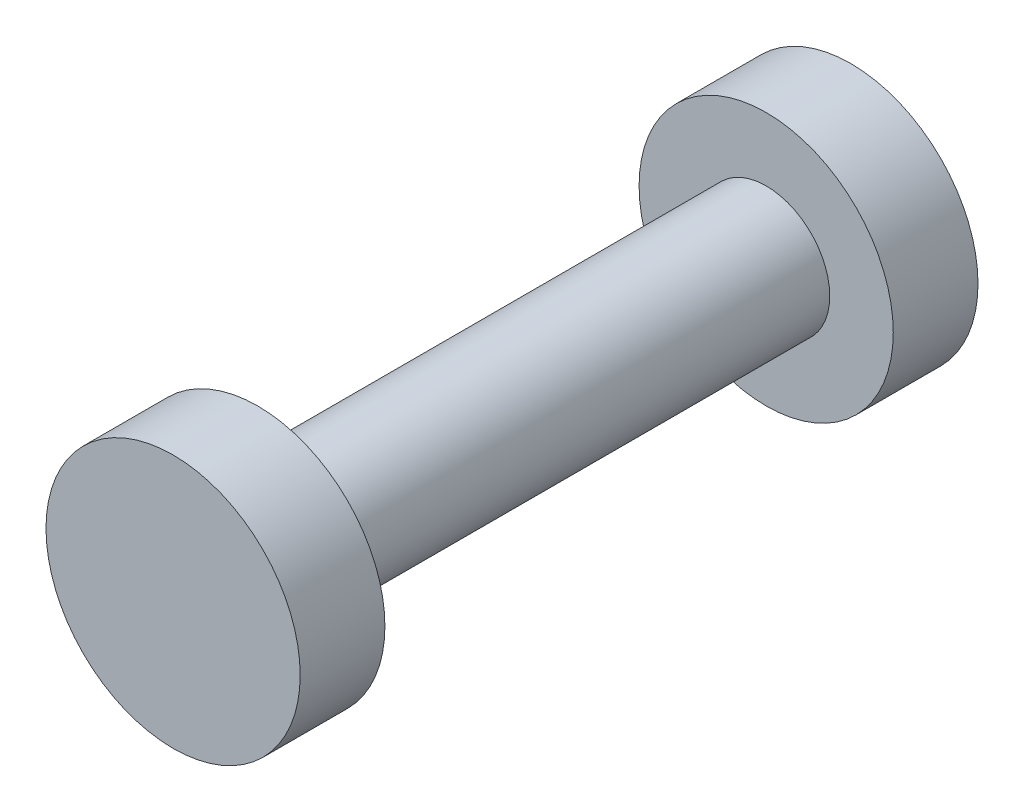
ISO-10303-21;
HEADER;
FILE_DESCRIPTION(('STEP AP214'),'2;1');
FILE_NAME('part.step','',(''),(''),'','','');
FILE_SCHEMA(('AUTOMOTIVE_DESIGN { 1 0 10303 214 1 1 1 1 }'));
ENDSEC;
DATA;
#1=APPLICATION_CONTEXT('core data for automotive mechanical design processes');
#2=APPLICATION_PROTOCOL_DEFINITION('international standard','automotive_design',2000,#1);
#3=PRODUCT_CONTEXT('',#1,'mechanical');
#4=PRODUCT('Part','Part','',(#3));
#5=PRODUCT_RELATED_PRODUCT_CATEGORY('part','',(#4));
#6=PRODUCT_DEFINITION_FORMATION('','',#4);
#7=PRODUCT_DEFINITION_CONTEXT('part definition',#1,'design');
#8=PRODUCT_DEFINITION('design','',#6,#7);
#9=PRODUCT_DEFINITION_SHAPE('','',#8);
#10=(LENGTH_UNIT() NAMED_UNIT(*) SI_UNIT(.MILLI.,.METRE.));
#11=(NAMED_UNIT(*) PLANE_ANGLE_UNIT() SI_UNIT($,.RADIAN.));
#12=(NAMED_UNIT(*) SI_UNIT($,.STERADIAN.) SOLID_ANGLE_UNIT());
#13=UNCERTAINTY_MEASURE_WITH_UNIT(LENGTH_MEASURE(1.E-05),#10,'distance_accuracy_value','');
#14=(GEOMETRIC_REPRESENTATION_CONTEXT(3) GLOBAL_UNCERTAINTY_ASSIGNED_CONTEXT((#13)) GLOBAL_UNIT_ASSIGNED_CONTEXT((#10,
#11,#12)) REPRESENTATION_CONTEXT('',''));
#15=CARTESIAN_POINT('',(0.,0.,0.));
#16=DIRECTION('',(0.,0.,1.));
#17=DIRECTION('',(1.,0.,0.));
#18=AXIS2_PLACEMENT_3D('',#15,#16,#17);
#19=CARTESIAN_POINT('',(0.,0.,15.24));
#20=DIRECTION('',(0.,0.,-1.));
#21=DIRECTION('',(-1.,0.,0.));
#22=AXIS2_PLACEMENT_3D('',#19,#20,#21);
#23=CYLINDRICAL_SURFACE('',#22,1.905);
#24=CARTESIAN_POINT('',(0.,0.,15.24));
#25=DIRECTION('',(0.,0.,1.));
#26=DIRECTION('',(1.,0.,0.));
#27=AXIS2_PLACEMENT_3D('',#24,#25,#26);
#28=CIRCLE('',#27,1.905);
#29=CARTESIAN_POINT('',(1.905,0.,15.24));
#30=VERTEX_POINT('',#29);
#31=EDGE_CURVE('E10',#30,#30,#28,.T.);
#32=ORIENTED_EDGE('',*,*,#31,.F.);
#33=EDGE_LOOP('',(#32));
#34=FACE_BOUND('',#33,.T.);
#35=CARTESIAN_POINT('',(0.,0.,0.));
#36=DIRECTION('',(0.,0.,1.));
#37=DIRECTION('',(1.,0.,0.));
#38=AXIS2_PLACEMENT_3D('',#35,#36,#37);
#39=CIRCLE('',#38,1.905);
#40=CARTESIAN_POINT('',(1.905,0.,0.));
#41=VERTEX_POINT('',#40);
#42=EDGE_CURVE('E40',#41,#41,#39,.T.);
#43=ORIENTED_EDGE('',*,*,#42,.T.);
#44=EDGE_LOOP('',(#43));
#45=FACE_BOUND('',#44,.T.);
#46=ADVANCED_FACE('F37',(#34,#45),#23,.T.);
#47=CARTESIAN_POINT('',(0.,0.,17.78));
#48=DIRECTION('',(0.,0.,-1.));
#49=DIRECTION('',(-1.,0.,0.));
#50=AXIS2_PLACEMENT_3D('',#47,#48,#49);
#51=CYLINDRICAL_SURFACE('',#50,3.81);
#52=CARTESIAN_POINT('',(0.,0.,17.78));
#53=DIRECTION('',(0.,0.,1.));
#54=DIRECTION('',(1.,0.,0.));
#55=AXIS2_PLACEMENT_3D('',#52,#53,#54);
#56=CIRCLE('',#55,3.81);
#57=CARTESIAN_POINT('',(3.81,0.,17.78));
#58=VERTEX_POINT('',#57);
#59=EDGE_CURVE('E45',#58,#58,#56,.T.);
#60=ORIENTED_EDGE('',*,*,#59,.F.);
#61=EDGE_LOOP('',(#60));
#62=FACE_BOUND('',#61,.T.);
#63=CARTESIAN_POINT('',(0.,0.,15.24));
#64=DIRECTION('',(0.,0.,1.));
#65=DIRECTION('',(1.,0.,0.));
#66=AXIS2_PLACEMENT_3D('',#63,#64,#65);
#67=CIRCLE('',#66,3.81);
#68=CARTESIAN_POINT('',(3.81,0.,15.24));
#69=VERTEX_POINT('',#68);
#70=EDGE_CURVE('E50',#69,#69,#67,.T.);
#71=ORIENTED_EDGE('',*,*,#70,.T.);
#72=EDGE_LOOP('',(#71));
#73=FACE_BOUND('',#72,.T.);
#74=ADVANCED_FACE('F91',(#62,#73),#51,.T.);
#75=CARTESIAN_POINT('',(0.,0.,17.78));
#76=DIRECTION('',(0.,0.,1.));
#77=DIRECTION('',(1.,0.,0.));
#78=AXIS2_PLACEMENT_3D('',#75,#76,#77);
#79=PLANE('',#78);
#80=ORIENTED_EDGE('',*,*,#59,.T.);
#81=EDGE_LOOP('',(#80));
#82=FACE_BOUND('',#81,.T.);
#83=ADVANCED_FACE('F87',(#82),#79,.T.);
#84=CARTESIAN_POINT('',(0.,0.,15.24));
#85=DIRECTION('',(0.,0.,1.));
#86=DIRECTION('',(1.,0.,0.));
#87=AXIS2_PLACEMENT_3D('',#84,#85,#86);
#88=PLANE('',#87);
#89=ORIENTED_EDGE('',*,*,#31,.T.);
#90=EDGE_LOOP('',(#89));
#91=FACE_BOUND('',#90,.T.);
#92=ORIENTED_EDGE('',*,*,#70,.F.);
#93=EDGE_LOOP('',(#92));
#94=FACE_BOUND('',#93,.T.);
#95=ADVANCED_FACE('F79',(#91,#94),#88,.F.);
#96=CARTESIAN_POINT('',(0.,0.,-2.54));
#97=DIRECTION('',(0.,0.,1.));
#98=DIRECTION('',(1.,0.,0.));
#99=AXIS2_PLACEMENT_3D('',#96,#97,#98);
#100=CYLINDRICAL_SURFACE('',#99,3.81);
#101=CARTESIAN_POINT('',(0.,0.,-2.54));
#102=DIRECTION('',(0.,0.,1.));
#103=DIRECTION('',(1.,0.,0.));
#104=AXIS2_PLACEMENT_3D('',#101,#102,#103);
#105=CIRCLE('',#104,3.81);
#106=CARTESIAN_POINT('',(3.81,0.,-2.54));
#107=VERTEX_POINT('',#106);
#108=EDGE_CURVE('E60',#107,#107,#105,.T.);
#109=ORIENTED_EDGE('',*,*,#108,.T.);
#110=EDGE_LOOP('',(#109));
#111=FACE_BOUND('',#110,.T.);
#112=CARTESIAN_POINT('',(0.,0.,0.));
#113=DIRECTION('',(0.,0.,1.));
#114=DIRECTION('',(1.,0.,0.));
#115=AXIS2_PLACEMENT_3D('',#112,#113,#114);
#116=CIRCLE('',#115,3.81);
#117=CARTESIAN_POINT('',(3.81,0.,0.));
#118=VERTEX_POINT('',#117);
#119=EDGE_CURVE('E56',#118,#118,#116,.T.);
#120=ORIENTED_EDGE('',*,*,#119,.F.);
#121=EDGE_LOOP('',(#120));
#122=FACE_BOUND('',#121,.T.);
#123=ADVANCED_FACE('F77',(#111,#122),#100,.T.);
#124=CARTESIAN_POINT('',(0.,0.,-2.54));
#125=DIRECTION('',(0.,0.,-1.));
#126=DIRECTION('',(1.,0.,0.));
#127=AXIS2_PLACEMENT_3D('',#124,#125,#126);
#128=PLANE('',#127);
#129=ORIENTED_EDGE('',*,*,#108,.F.);
#130=EDGE_LOOP('',(#129));
#131=FACE_BOUND('',#130,.T.);
#132=ADVANCED_FACE('F73',(#131),#128,.T.);
#133=CARTESIAN_POINT('',(0.,0.,0.));
#134=DIRECTION('',(0.,0.,-1.));
#135=DIRECTION('',(1.,0.,0.));
#136=AXIS2_PLACEMENT_3D('',#133,#134,#135);
#137=PLANE('',#136);
#138=ORIENTED_EDGE('',*,*,#42,.F.);
#139=EDGE_LOOP('',(#138));
#140=FACE_BOUND('',#139,.T.);
#141=ORIENTED_EDGE('',*,*,#119,.T.);
#142=EDGE_LOOP('',(#141));
#143=FACE_BOUND('',#142,.T.);
#144=ADVANCED_FACE('F70',(#140,#143),#137,.F.);
#145=CLOSED_SHELL('',(#46,#74,#83,#95,#123,#132,#144));
#146=MANIFOLD_SOLID_BREP('B2',#145);
#147=ADVANCED_BREP_SHAPE_REPRESENTATION('',(#18,#146),#14);
#148=SHAPE_DEFINITION_REPRESENTATION(#9,#147);
ENDSEC;
END-ISO-10303-21;
